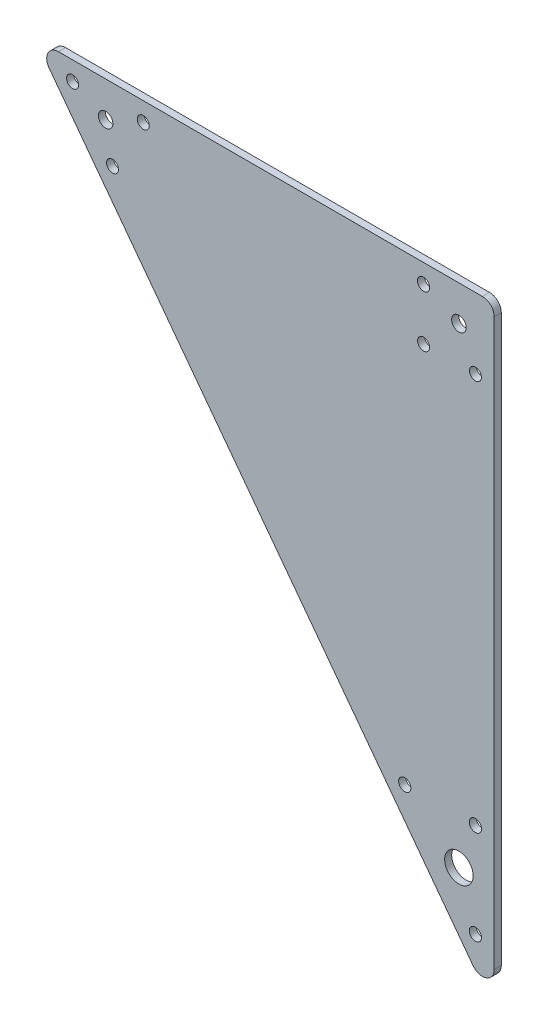
ISO-10303-21;
HEADER;
FILE_DESCRIPTION(('STEP AP214'),'2;1');
FILE_NAME('part.step','',(''),(''),'','','');
FILE_SCHEMA(('AUTOMOTIVE_DESIGN { 1 0 10303 214 1 1 1 1 }'));
ENDSEC;
DATA;
#1=APPLICATION_CONTEXT('core data for automotive mechanical design processes');
#2=APPLICATION_PROTOCOL_DEFINITION('international standard','automotive_design',2000,#1);
#3=PRODUCT_CONTEXT('',#1,'mechanical');
#4=PRODUCT('Part','Part','',(#3));
#5=PRODUCT_RELATED_PRODUCT_CATEGORY('part','',(#4));
#6=PRODUCT_DEFINITION_FORMATION('','',#4);
#7=PRODUCT_DEFINITION_CONTEXT('part definition',#1,'design');
#8=PRODUCT_DEFINITION('design','',#6,#7);
#9=PRODUCT_DEFINITION_SHAPE('','',#8);
#10=(LENGTH_UNIT() NAMED_UNIT(*) SI_UNIT(.MILLI.,.METRE.));
#11=(NAMED_UNIT(*) PLANE_ANGLE_UNIT() SI_UNIT($,.RADIAN.));
#12=(NAMED_UNIT(*) SI_UNIT($,.STERADIAN.) SOLID_ANGLE_UNIT());
#13=UNCERTAINTY_MEASURE_WITH_UNIT(LENGTH_MEASURE(1.E-05),#10,'distance_accuracy_value','');
#14=(GEOMETRIC_REPRESENTATION_CONTEXT(3) GLOBAL_UNCERTAINTY_ASSIGNED_CONTEXT((#13)) GLOBAL_UNIT_ASSIGNED_CONTEXT((#10,
#11,#12)) REPRESENTATION_CONTEXT('',''));
#15=CARTESIAN_POINT('',(0.,0.,0.));
#16=DIRECTION('',(0.,0.,1.));
#17=DIRECTION('',(1.,0.,0.));
#18=AXIS2_PLACEMENT_3D('',#15,#16,#17);
#19=CARTESIAN_POINT('',(0.,0.,3.));
#20=DIRECTION('',(0.,0.,1.));
#21=DIRECTION('',(1.,0.,0.));
#22=AXIS2_PLACEMENT_3D('',#19,#20,#21);
#23=PLANE('',#22);
#24=CARTESIAN_POINT('',(-23.,-181.,3.));
#25=DIRECTION('',(0.,0.,1.));
#26=DIRECTION('',(1.,0.,0.));
#27=AXIS2_PLACEMENT_3D('',#24,#25,#26);
#28=CIRCLE('',#27,2.6);
#29=CARTESIAN_POINT('',(-20.4,-181.,3.));
#30=VERTEX_POINT('',#29);
#31=EDGE_CURVE('E183',#30,#30,#28,.T.);
#32=ORIENTED_EDGE('',*,*,#31,.F.);
#33=EDGE_LOOP('',(#32));
#34=FACE_BOUND('',#33,.T.);
#35=CARTESIAN_POINT('',(-147.048935520436,-15.6014193060854,3.));
#36=DIRECTION('',(0.,0.,1.));
#37=DIRECTION('',(1.,0.,0.));
#38=AXIS2_PLACEMENT_3D('',#35,#36,#37);
#39=CIRCLE('',#38,2.54999999999999);
#40=CARTESIAN_POINT('',(-144.498935520436,-15.6014193060854,3.));
#41=VERTEX_POINT('',#40);
#42=EDGE_CURVE('E195',#41,#41,#39,.T.);
#43=ORIENTED_EDGE('',*,*,#42,.F.);
#44=EDGE_LOOP('',(#43));
#45=FACE_BOUND('',#44,.T.);
#46=CARTESIAN_POINT('',(-164.,7.,3.));
#47=DIRECTION('',(0.,0.,1.));
#48=DIRECTION('',(1.,0.,0.));
#49=AXIS2_PLACEMENT_3D('',#46,#47,#48);
#50=CIRCLE('',#49,2.54999999999999);
#51=CARTESIAN_POINT('',(-161.45,7.,3.));
#52=VERTEX_POINT('',#51);
#53=EDGE_CURVE('E205',#52,#52,#50,.T.);
#54=ORIENTED_EDGE('',*,*,#53,.F.);
#55=EDGE_LOOP('',(#54));
#56=FACE_BOUND('',#55,.T.);
#57=CARTESIAN_POINT('',(-15.,-15.,3.));
#58=DIRECTION('',(0.,0.,1.));
#59=DIRECTION('',(1.,0.,0.));
#60=AXIS2_PLACEMENT_3D('',#57,#58,#59);
#61=CIRCLE('',#60,2.54999999999999);
#62=CARTESIAN_POINT('',(-12.45,-15.,3.));
#63=VERTEX_POINT('',#62);
#64=EDGE_CURVE('E215',#63,#63,#61,.T.);
#65=ORIENTED_EDGE('',*,*,#64,.F.);
#66=EDGE_LOOP('',(#65));
#67=FACE_BOUND('',#66,.T.);
#68=CARTESIAN_POINT('',(0.,-200.,3.));
#69=DIRECTION('',(0.,0.,1.));
#70=DIRECTION('',(1.,0.,0.));
#71=AXIS2_PLACEMENT_3D('',#68,#69,#70);
#72=CIRCLE('',#71,6.05);
#73=CARTESIAN_POINT('',(6.05000000000002,-200.,3.));
#74=VERTEX_POINT('',#73);
#75=EDGE_CURVE('E225',#74,#74,#72,.T.);
#76=ORIENTED_EDGE('',*,*,#75,.F.);
#77=EDGE_LOOP('',(#76));
#78=FACE_BOUND('',#77,.T.);
#79=CARTESIAN_POINT('',(0.,0.,3.));
#80=DIRECTION('',(0.,0.,1.));
#81=DIRECTION('',(1.,0.,0.));
#82=AXIS2_PLACEMENT_3D('',#79,#80,#81);
#83=CIRCLE('',#82,3.1);
#84=CARTESIAN_POINT('',(3.1,0.,3.));
#85=VERTEX_POINT('',#84);
#86=EDGE_CURVE('E119',#85,#85,#83,.T.);
#87=ORIENTED_EDGE('',*,*,#86,.F.);
#88=EDGE_LOOP('',(#87));
#89=FACE_BOUND('',#88,.T.);
#90=DIRECTION('',(0.6,-0.8,0.));
#91=VECTOR('',#90,1.);
#92=CARTESIAN_POINT('',(-180.,15.,3.));
#93=LINE('',#92,#91);
#94=CARTESIAN_POINT('',(-174.,6.99999999999999,3.));
#95=VERTEX_POINT('',#94);
#96=CARTESIAN_POINT('',(6.00000000000006,-233.,3.));
#97=VERTEX_POINT('',#96);
#98=EDGE_CURVE('E117',#95,#97,#93,.T.);
#99=ORIENTED_EDGE('',*,*,#98,.T.);
#100=CARTESIAN_POINT('',(10.,-230.,3.));
#101=DIRECTION('',(0.,0.,1.));
#102=DIRECTION('',(1.,0.,0.));
#103=AXIS2_PLACEMENT_3D('',#100,#101,#102);
#104=CIRCLE('',#103,5.);
#105=CARTESIAN_POINT('',(15.,-230.,3.));
#106=VERTEX_POINT('',#105);
#107=EDGE_CURVE('E133',#97,#106,#104,.T.);
#108=ORIENTED_EDGE('',*,*,#107,.T.);
#109=DIRECTION('',(0.,1.,0.));
#110=VECTOR('',#109,1.);
#111=CARTESIAN_POINT('',(15.,15.,3.));
#112=LINE('',#111,#110);
#113=CARTESIAN_POINT('',(15.,10.,3.));
#114=VERTEX_POINT('',#113);
#115=EDGE_CURVE('E107',#106,#114,#112,.T.);
#116=ORIENTED_EDGE('',*,*,#115,.T.);
#117=CARTESIAN_POINT('',(9.99999999999998,10.,3.));
#118=DIRECTION('',(0.,0.,1.));
#119=DIRECTION('',(1.,0.,0.));
#120=AXIS2_PLACEMENT_3D('',#117,#118,#119);
#121=CIRCLE('',#120,5.);
#122=CARTESIAN_POINT('',(9.99999999999998,15.,3.));
#123=VERTEX_POINT('',#122);
#124=EDGE_CURVE('E55',#114,#123,#121,.T.);
#125=ORIENTED_EDGE('',*,*,#124,.T.);
#126=DIRECTION('',(-1.,0.,0.));
#127=VECTOR('',#126,1.);
#128=CARTESIAN_POINT('',(-180.,15.,3.));
#129=LINE('',#128,#127);
#130=CARTESIAN_POINT('',(-170.,15.,3.));
#131=VERTEX_POINT('',#130);
#132=EDGE_CURVE('E123',#123,#131,#129,.T.);
#133=ORIENTED_EDGE('',*,*,#132,.T.);
#134=CARTESIAN_POINT('',(-170.,10.,3.));
#135=DIRECTION('',(0.,0.,1.));
#136=DIRECTION('',(1.,0.,0.));
#137=AXIS2_PLACEMENT_3D('',#134,#135,#136);
#138=CIRCLE('',#137,5.);
#139=EDGE_CURVE('E131',#131,#95,#138,.T.);
#140=ORIENTED_EDGE('',*,*,#139,.T.);
#141=EDGE_LOOP('',(#99,#108,#116,#125,#133,#140));
#142=FACE_BOUND('',#141,.T.);
#143=CARTESIAN_POINT('',(-150.,0.,3.));
#144=DIRECTION('',(0.,0.,1.));
#145=DIRECTION('',(1.,0.,0.));
#146=AXIS2_PLACEMENT_3D('',#143,#144,#145);
#147=CIRCLE('',#146,3.09999999999999);
#148=CARTESIAN_POINT('',(-146.9,0.,3.));
#149=VERTEX_POINT('',#148);
#150=EDGE_CURVE('E158',#149,#149,#147,.T.);
#151=ORIENTED_EDGE('',*,*,#150,.F.);
#152=EDGE_LOOP('',(#151));
#153=FACE_BOUND('',#152,.T.);
#154=CARTESIAN_POINT('',(-15.,7.,3.));
#155=DIRECTION('',(0.,0.,1.));
#156=DIRECTION('',(1.,0.,0.));
#157=AXIS2_PLACEMENT_3D('',#154,#155,#156);
#158=CIRCLE('',#157,2.6);
#159=CARTESIAN_POINT('',(-12.4,7.,3.));
#160=VERTEX_POINT('',#159);
#161=EDGE_CURVE('E162',#160,#160,#158,.T.);
#162=ORIENTED_EDGE('',*,*,#161,.F.);
#163=EDGE_LOOP('',(#162));
#164=FACE_BOUND('',#163,.T.);
#165=CARTESIAN_POINT('',(7.,-15.,3.));
#166=DIRECTION('',(0.,0.,1.));
#167=DIRECTION('',(1.,0.,0.));
#168=AXIS2_PLACEMENT_3D('',#165,#166,#167);
#169=CIRCLE('',#168,2.55);
#170=CARTESIAN_POINT('',(9.55,-15.,3.));
#171=VERTEX_POINT('',#170);
#172=EDGE_CURVE('E166',#171,#171,#169,.T.);
#173=ORIENTED_EDGE('',*,*,#172,.F.);
#174=EDGE_LOOP('',(#173));
#175=FACE_BOUND('',#174,.T.);
#176=CARTESIAN_POINT('',(-134.,7.,3.));
#177=DIRECTION('',(0.,0.,1.));
#178=DIRECTION('',(1.,0.,0.));
#179=AXIS2_PLACEMENT_3D('',#176,#177,#178);
#180=CIRCLE('',#179,2.54999999999999);
#181=CARTESIAN_POINT('',(-131.45,7.,3.));
#182=VERTEX_POINT('',#181);
#183=EDGE_CURVE('E170',#182,#182,#180,.T.);
#184=ORIENTED_EDGE('',*,*,#183,.F.);
#185=EDGE_LOOP('',(#184));
#186=FACE_BOUND('',#185,.T.);
#187=CARTESIAN_POINT('',(7.00000000000002,-221.,3.));
#188=DIRECTION('',(0.,0.,1.));
#189=DIRECTION('',(1.,0.,0.));
#190=AXIS2_PLACEMENT_3D('',#187,#188,#189);
#191=CIRCLE('',#190,2.6);
#192=CARTESIAN_POINT('',(9.60000000000002,-221.,3.));
#193=VERTEX_POINT('',#192);
#194=EDGE_CURVE('E174',#193,#193,#191,.T.);
#195=ORIENTED_EDGE('',*,*,#194,.F.);
#196=EDGE_LOOP('',(#195));
#197=FACE_BOUND('',#196,.T.);
#198=CARTESIAN_POINT('',(7.00000000000003,-181.,3.));
#199=DIRECTION('',(0.,0.,1.));
#200=DIRECTION('',(1.,0.,0.));
#201=AXIS2_PLACEMENT_3D('',#198,#199,#200);
#202=CIRCLE('',#201,2.6);
#203=CARTESIAN_POINT('',(9.60000000000002,-181.,3.));
#204=VERTEX_POINT('',#203);
#205=EDGE_CURVE('E177',#204,#204,#202,.T.);
#206=ORIENTED_EDGE('',*,*,#205,.F.);
#207=EDGE_LOOP('',(#206));
#208=FACE_BOUND('',#207,.T.);
#209=ADVANCED_FACE('F35',(#34,#45,#56,#67,#78,#89,#142,#153,#164,#175,#186,#197,#208),#23,.T.);
#210=CARTESIAN_POINT('',(0.,0.,0.));
#211=DIRECTION('',(0.,0.,1.));
#212=DIRECTION('',(1.,0.,0.));
#213=AXIS2_PLACEMENT_3D('',#210,#211,#212);
#214=PLANE('',#213);
#215=DIRECTION('',(0.,1.,0.));
#216=VECTOR('',#215,1.);
#217=CARTESIAN_POINT('',(15.,15.,0.));
#218=LINE('',#217,#216);
#219=CARTESIAN_POINT('',(15.,-230.,0.));
#220=VERTEX_POINT('',#219);
#221=CARTESIAN_POINT('',(15.,10.,0.));
#222=VERTEX_POINT('',#221);
#223=EDGE_CURVE('E105',#220,#222,#218,.T.);
#224=ORIENTED_EDGE('',*,*,#223,.F.);
#225=CARTESIAN_POINT('',(10.,-230.,0.));
#226=DIRECTION('',(0.,0.,1.));
#227=DIRECTION('',(1.,0.,0.));
#228=AXIS2_PLACEMENT_3D('',#225,#226,#227);
#229=CIRCLE('',#228,5.);
#230=CARTESIAN_POINT('',(6.00000000000006,-233.,0.));
#231=VERTEX_POINT('',#230);
#232=EDGE_CURVE('E88',#220,#231,#229,.F.);
#233=ORIENTED_EDGE('',*,*,#232,.T.);
#234=DIRECTION('',(0.6,-0.8,0.));
#235=VECTOR('',#234,1.);
#236=CARTESIAN_POINT('',(-180.,15.,0.));
#237=LINE('',#236,#235);
#238=CARTESIAN_POINT('',(-174.,6.99999999999999,0.));
#239=VERTEX_POINT('',#238);
#240=EDGE_CURVE('E115',#239,#231,#237,.T.);
#241=ORIENTED_EDGE('',*,*,#240,.F.);
#242=CARTESIAN_POINT('',(-170.,10.,0.));
#243=DIRECTION('',(0.,0.,1.));
#244=DIRECTION('',(1.,0.,0.));
#245=AXIS2_PLACEMENT_3D('',#242,#243,#244);
#246=CIRCLE('',#245,5.);
#247=CARTESIAN_POINT('',(-170.,15.,0.));
#248=VERTEX_POINT('',#247);
#249=EDGE_CURVE('E99',#239,#248,#246,.F.);
#250=ORIENTED_EDGE('',*,*,#249,.T.);
#251=DIRECTION('',(-1.,0.,0.));
#252=VECTOR('',#251,1.);
#253=CARTESIAN_POINT('',(-180.,15.,0.));
#254=LINE('',#253,#252);
#255=CARTESIAN_POINT('',(9.99999999999998,15.,0.));
#256=VERTEX_POINT('',#255);
#257=EDGE_CURVE('E114',#256,#248,#254,.T.);
#258=ORIENTED_EDGE('',*,*,#257,.F.);
#259=CARTESIAN_POINT('',(9.99999999999998,10.,0.));
#260=DIRECTION('',(0.,0.,1.));
#261=DIRECTION('',(1.,0.,0.));
#262=AXIS2_PLACEMENT_3D('',#259,#260,#261);
#263=CIRCLE('',#262,5.);
#264=EDGE_CURVE('E108',#256,#222,#263,.F.);
#265=ORIENTED_EDGE('',*,*,#264,.T.);
#266=EDGE_LOOP('',(#224,#233,#241,#250,#258,#265));
#267=FACE_BOUND('',#266,.T.);
#268=CARTESIAN_POINT('',(0.,0.,0.));
#269=DIRECTION('',(0.,0.,1.));
#270=DIRECTION('',(1.,0.,0.));
#271=AXIS2_PLACEMENT_3D('',#268,#269,#270);
#272=CIRCLE('',#271,3.1);
#273=CARTESIAN_POINT('',(3.1,0.,0.));
#274=VERTEX_POINT('',#273);
#275=EDGE_CURVE('E149',#274,#274,#272,.T.);
#276=ORIENTED_EDGE('',*,*,#275,.T.);
#277=EDGE_LOOP('',(#276));
#278=FACE_BOUND('',#277,.T.);
#279=CARTESIAN_POINT('',(-150.,0.,0.));
#280=DIRECTION('',(0.,0.,1.));
#281=DIRECTION('',(1.,0.,0.));
#282=AXIS2_PLACEMENT_3D('',#279,#280,#281);
#283=CIRCLE('',#282,3.09999999999999);
#284=CARTESIAN_POINT('',(-146.9,0.,0.));
#285=VERTEX_POINT('',#284);
#286=EDGE_CURVE('E228',#285,#285,#283,.T.);
#287=ORIENTED_EDGE('',*,*,#286,.T.);
#288=EDGE_LOOP('',(#287));
#289=FACE_BOUND('',#288,.T.);
#290=CARTESIAN_POINT('',(0.,-200.,0.));
#291=DIRECTION('',(0.,0.,1.));
#292=DIRECTION('',(1.,0.,0.));
#293=AXIS2_PLACEMENT_3D('',#290,#291,#292);
#294=CIRCLE('',#293,6.05);
#295=CARTESIAN_POINT('',(6.05000000000002,-200.,0.));
#296=VERTEX_POINT('',#295);
#297=EDGE_CURVE('E222',#296,#296,#294,.T.);
#298=ORIENTED_EDGE('',*,*,#297,.T.);
#299=EDGE_LOOP('',(#298));
#300=FACE_BOUND('',#299,.T.);
#301=CARTESIAN_POINT('',(-15.,7.,0.));
#302=DIRECTION('',(0.,0.,1.));
#303=DIRECTION('',(1.,0.,0.));
#304=AXIS2_PLACEMENT_3D('',#301,#302,#303);
#305=CIRCLE('',#304,2.6);
#306=CARTESIAN_POINT('',(-12.4,7.,0.));
#307=VERTEX_POINT('',#306);
#308=EDGE_CURVE('E218',#307,#307,#305,.T.);
#309=ORIENTED_EDGE('',*,*,#308,.T.);
#310=EDGE_LOOP('',(#309));
#311=FACE_BOUND('',#310,.T.);
#312=CARTESIAN_POINT('',(-15.,-15.,0.));
#313=DIRECTION('',(0.,0.,1.));
#314=DIRECTION('',(1.,0.,0.));
#315=AXIS2_PLACEMENT_3D('',#312,#313,#314);
#316=CIRCLE('',#315,2.54999999999999);
#317=CARTESIAN_POINT('',(-12.45,-15.,0.));
#318=VERTEX_POINT('',#317);
#319=EDGE_CURVE('E212',#318,#318,#316,.T.);
#320=ORIENTED_EDGE('',*,*,#319,.T.);
#321=EDGE_LOOP('',(#320));
#322=FACE_BOUND('',#321,.T.);
#323=CARTESIAN_POINT('',(7.,-15.,0.));
#324=DIRECTION('',(0.,0.,1.));
#325=DIRECTION('',(1.,0.,0.));
#326=AXIS2_PLACEMENT_3D('',#323,#324,#325);
#327=CIRCLE('',#326,2.55);
#328=CARTESIAN_POINT('',(9.55,-15.,0.));
#329=VERTEX_POINT('',#328);
#330=EDGE_CURVE('E208',#329,#329,#327,.T.);
#331=ORIENTED_EDGE('',*,*,#330,.T.);
#332=EDGE_LOOP('',(#331));
#333=FACE_BOUND('',#332,.T.);
#334=CARTESIAN_POINT('',(-164.,7.,0.));
#335=DIRECTION('',(0.,0.,1.));
#336=DIRECTION('',(1.,0.,0.));
#337=AXIS2_PLACEMENT_3D('',#334,#335,#336);
#338=CIRCLE('',#337,2.54999999999999);
#339=CARTESIAN_POINT('',(-161.45,7.,0.));
#340=VERTEX_POINT('',#339);
#341=EDGE_CURVE('E202',#340,#340,#338,.T.);
#342=ORIENTED_EDGE('',*,*,#341,.T.);
#343=EDGE_LOOP('',(#342));
#344=FACE_BOUND('',#343,.T.);
#345=CARTESIAN_POINT('',(-134.,7.,0.));
#346=DIRECTION('',(0.,0.,1.));
#347=DIRECTION('',(1.,0.,0.));
#348=AXIS2_PLACEMENT_3D('',#345,#346,#347);
#349=CIRCLE('',#348,2.54999999999999);
#350=CARTESIAN_POINT('',(-131.45,7.,0.));
#351=VERTEX_POINT('',#350);
#352=EDGE_CURVE('E198',#351,#351,#349,.T.);
#353=ORIENTED_EDGE('',*,*,#352,.T.);
#354=EDGE_LOOP('',(#353));
#355=FACE_BOUND('',#354,.T.);
#356=CARTESIAN_POINT('',(-147.048935520436,-15.6014193060854,0.));
#357=DIRECTION('',(0.,0.,1.));
#358=DIRECTION('',(1.,0.,0.));
#359=AXIS2_PLACEMENT_3D('',#356,#357,#358);
#360=CIRCLE('',#359,2.54999999999999);
#361=CARTESIAN_POINT('',(-144.498935520436,-15.6014193060854,0.));
#362=VERTEX_POINT('',#361);
#363=EDGE_CURVE('E192',#362,#362,#360,.T.);
#364=ORIENTED_EDGE('',*,*,#363,.T.);
#365=EDGE_LOOP('',(#364));
#366=FACE_BOUND('',#365,.T.);
#367=CARTESIAN_POINT('',(7.00000000000002,-221.,0.));
#368=DIRECTION('',(0.,0.,1.));
#369=DIRECTION('',(1.,0.,0.));
#370=AXIS2_PLACEMENT_3D('',#367,#368,#369);
#371=CIRCLE('',#370,2.6);
#372=CARTESIAN_POINT('',(9.60000000000002,-221.,0.));
#373=VERTEX_POINT('',#372);
#374=EDGE_CURVE('E189',#373,#373,#371,.T.);
#375=ORIENTED_EDGE('',*,*,#374,.T.);
#376=EDGE_LOOP('',(#375));
#377=FACE_BOUND('',#376,.T.);
#378=CARTESIAN_POINT('',(-23.,-181.,0.));
#379=DIRECTION('',(0.,0.,1.));
#380=DIRECTION('',(1.,0.,0.));
#381=AXIS2_PLACEMENT_3D('',#378,#379,#380);
#382=CIRCLE('',#381,2.6);
#383=CARTESIAN_POINT('',(-20.4,-181.,0.));
#384=VERTEX_POINT('',#383);
#385=EDGE_CURVE('E179',#384,#384,#382,.T.);
#386=ORIENTED_EDGE('',*,*,#385,.T.);
#387=EDGE_LOOP('',(#386));
#388=FACE_BOUND('',#387,.T.);
#389=CARTESIAN_POINT('',(7.00000000000003,-181.,0.));
#390=DIRECTION('',(0.,0.,1.));
#391=DIRECTION('',(1.,0.,0.));
#392=AXIS2_PLACEMENT_3D('',#389,#390,#391);
#393=CIRCLE('',#392,2.6);
#394=CARTESIAN_POINT('',(9.60000000000002,-181.,0.));
#395=VERTEX_POINT('',#394);
#396=EDGE_CURVE('E180',#395,#395,#393,.T.);
#397=ORIENTED_EDGE('',*,*,#396,.T.);
#398=EDGE_LOOP('',(#397));
#399=FACE_BOUND('',#398,.T.);
#400=ADVANCED_FACE('F111',(#267,#278,#289,#300,#311,#322,#333,#344,#355,#366,#377,#388,#399),
#214,.F.);
#401=CARTESIAN_POINT('',(-180.,15.,3.));
#402=DIRECTION('',(0.8,0.6,0.));
#403=DIRECTION('',(-0.6,0.8,0.));
#404=AXIS2_PLACEMENT_3D('',#401,#402,#403);
#405=PLANE('',#404);
#406=ORIENTED_EDGE('',*,*,#240,.T.);
#407=DIRECTION('',(0.,0.,-1.));
#408=VECTOR('',#407,1.);
#409=CARTESIAN_POINT('',(6.00000000000001,-233.,3.));
#410=LINE('',#409,#408);
#411=EDGE_CURVE('E93',#231,#97,#410,.F.);
#412=ORIENTED_EDGE('',*,*,#411,.T.);
#413=ORIENTED_EDGE('',*,*,#98,.F.);
#414=DIRECTION('',(0.,0.,-1.));
#415=VECTOR('',#414,1.);
#416=CARTESIAN_POINT('',(-174.,7.,3.));
#417=LINE('',#416,#415);
#418=EDGE_CURVE('E98',#95,#239,#417,.T.);
#419=ORIENTED_EDGE('',*,*,#418,.T.);
#420=EDGE_LOOP('',(#406,#412,#413,#419));
#421=FACE_BOUND('',#420,.T.);
#422=ADVANCED_FACE('F144',(#421),#405,.F.);
#423=CARTESIAN_POINT('',(15.,15.,3.));
#424=DIRECTION('',(-1.,0.,0.));
#425=DIRECTION('',(0.,-1.,0.));
#426=AXIS2_PLACEMENT_3D('',#423,#424,#425);
#427=PLANE('',#426);
#428=ORIENTED_EDGE('',*,*,#115,.F.);
#429=DIRECTION('',(0.,0.,-1.));
#430=VECTOR('',#429,1.);
#431=CARTESIAN_POINT('',(15.,-230.,3.));
#432=LINE('',#431,#430);
#433=EDGE_CURVE('E92',#106,#220,#432,.T.);
#434=ORIENTED_EDGE('',*,*,#433,.T.);
#435=ORIENTED_EDGE('',*,*,#223,.T.);
#436=DIRECTION('',(0.,0.,-1.));
#437=VECTOR('',#436,1.);
#438=CARTESIAN_POINT('',(15.,10.,3.));
#439=LINE('',#438,#437);
#440=EDGE_CURVE('E109',#222,#114,#439,.F.);
#441=ORIENTED_EDGE('',*,*,#440,.T.);
#442=EDGE_LOOP('',(#428,#434,#435,#441));
#443=FACE_BOUND('',#442,.T.);
#444=ADVANCED_FACE('F104',(#443),#427,.F.);
#445=CARTESIAN_POINT('',(-180.,15.,3.));
#446=DIRECTION('',(0.,-1.,0.));
#447=DIRECTION('',(0.,0.,-1.));
#448=AXIS2_PLACEMENT_3D('',#445,#446,#447);
#449=PLANE('',#448);
#450=ORIENTED_EDGE('',*,*,#257,.T.);
#451=DIRECTION('',(0.,0.,-1.));
#452=VECTOR('',#451,1.);
#453=CARTESIAN_POINT('',(-170.,15.,3.));
#454=LINE('',#453,#452);
#455=EDGE_CURVE('E11',#248,#131,#454,.F.);
#456=ORIENTED_EDGE('',*,*,#455,.T.);
#457=ORIENTED_EDGE('',*,*,#132,.F.);
#458=DIRECTION('',(0.,0.,-1.));
#459=VECTOR('',#458,1.);
#460=CARTESIAN_POINT('',(9.99999999999998,15.,3.));
#461=LINE('',#460,#459);
#462=EDGE_CURVE('E43',#123,#256,#461,.T.);
#463=ORIENTED_EDGE('',*,*,#462,.T.);
#464=EDGE_LOOP('',(#450,#456,#457,#463));
#465=FACE_BOUND('',#464,.T.);
#466=ADVANCED_FACE('F136',(#465),#449,.F.);
#467=CARTESIAN_POINT('',(0.,0.,3.));
#468=DIRECTION('',(0.,0.,-1.));
#469=DIRECTION('',(-1.,0.,0.));
#470=AXIS2_PLACEMENT_3D('',#467,#468,#469);
#471=CYLINDRICAL_SURFACE('',#470,3.1);
#472=ORIENTED_EDGE('',*,*,#86,.T.);
#473=EDGE_LOOP('',(#472));
#474=FACE_BOUND('',#473,.T.);
#475=ORIENTED_EDGE('',*,*,#275,.F.);
#476=EDGE_LOOP('',(#475));
#477=FACE_BOUND('',#476,.T.);
#478=ADVANCED_FACE('F240',(#474,#477),#471,.F.);
#479=CARTESIAN_POINT('',(-150.,0.,3.));
#480=DIRECTION('',(0.,0.,-1.));
#481=DIRECTION('',(-1.,0.,0.));
#482=AXIS2_PLACEMENT_3D('',#479,#480,#481);
#483=CYLINDRICAL_SURFACE('',#482,3.09999999999999);
#484=ORIENTED_EDGE('',*,*,#150,.T.);
#485=EDGE_LOOP('',(#484));
#486=FACE_BOUND('',#485,.T.);
#487=ORIENTED_EDGE('',*,*,#286,.F.);
#488=EDGE_LOOP('',(#487));
#489=FACE_BOUND('',#488,.T.);
#490=ADVANCED_FACE('F242',(#486,#489),#483,.F.);
#491=CARTESIAN_POINT('',(0.,-200.,3.));
#492=DIRECTION('',(0.,0.,-1.));
#493=DIRECTION('',(-1.,0.,0.));
#494=AXIS2_PLACEMENT_3D('',#491,#492,#493);
#495=CYLINDRICAL_SURFACE('',#494,6.05);
#496=ORIENTED_EDGE('',*,*,#75,.T.);
#497=EDGE_LOOP('',(#496));
#498=FACE_BOUND('',#497,.T.);
#499=ORIENTED_EDGE('',*,*,#297,.F.);
#500=EDGE_LOOP('',(#499));
#501=FACE_BOUND('',#500,.T.);
#502=ADVANCED_FACE('F248',(#498,#501),#495,.F.);
#503=CARTESIAN_POINT('',(-15.,7.,3.));
#504=DIRECTION('',(0.,0.,-1.));
#505=DIRECTION('',(-1.,0.,0.));
#506=AXIS2_PLACEMENT_3D('',#503,#504,#505);
#507=CYLINDRICAL_SURFACE('',#506,2.6);
#508=ORIENTED_EDGE('',*,*,#161,.T.);
#509=EDGE_LOOP('',(#508));
#510=FACE_BOUND('',#509,.T.);
#511=ORIENTED_EDGE('',*,*,#308,.F.);
#512=EDGE_LOOP('',(#511));
#513=FACE_BOUND('',#512,.T.);
#514=ADVANCED_FACE('F387',(#510,#513),#507,.F.);
#515=CARTESIAN_POINT('',(-15.,-15.,3.));
#516=DIRECTION('',(0.,0.,-1.));
#517=DIRECTION('',(-1.,0.,0.));
#518=AXIS2_PLACEMENT_3D('',#515,#516,#517);
#519=CYLINDRICAL_SURFACE('',#518,2.54999999999999);
#520=ORIENTED_EDGE('',*,*,#64,.T.);
#521=EDGE_LOOP('',(#520));
#522=FACE_BOUND('',#521,.T.);
#523=ORIENTED_EDGE('',*,*,#319,.F.);
#524=EDGE_LOOP('',(#523));
#525=FACE_BOUND('',#524,.T.);
#526=ADVANCED_FACE('F377',(#522,#525),#519,.F.);
#527=CARTESIAN_POINT('',(7.,-15.,3.));
#528=DIRECTION('',(0.,0.,-1.));
#529=DIRECTION('',(-1.,0.,0.));
#530=AXIS2_PLACEMENT_3D('',#527,#528,#529);
#531=CYLINDRICAL_SURFACE('',#530,2.55);
#532=ORIENTED_EDGE('',*,*,#172,.T.);
#533=EDGE_LOOP('',(#532));
#534=FACE_BOUND('',#533,.T.);
#535=ORIENTED_EDGE('',*,*,#330,.F.);
#536=EDGE_LOOP('',(#535));
#537=FACE_BOUND('',#536,.T.);
#538=ADVANCED_FACE('F367',(#534,#537),#531,.F.);
#539=CARTESIAN_POINT('',(-164.,7.,3.));
#540=DIRECTION('',(0.,0.,-1.));
#541=DIRECTION('',(-1.,0.,0.));
#542=AXIS2_PLACEMENT_3D('',#539,#540,#541);
#543=CYLINDRICAL_SURFACE('',#542,2.54999999999999);
#544=ORIENTED_EDGE('',*,*,#53,.T.);
#545=EDGE_LOOP('',(#544));
#546=FACE_BOUND('',#545,.T.);
#547=ORIENTED_EDGE('',*,*,#341,.F.);
#548=EDGE_LOOP('',(#547));
#549=FACE_BOUND('',#548,.T.);
#550=ADVANCED_FACE('F357',(#546,#549),#543,.F.);
#551=CARTESIAN_POINT('',(-134.,7.,3.));
#552=DIRECTION('',(0.,0.,-1.));
#553=DIRECTION('',(-1.,0.,0.));
#554=AXIS2_PLACEMENT_3D('',#551,#552,#553);
#555=CYLINDRICAL_SURFACE('',#554,2.54999999999999);
#556=ORIENTED_EDGE('',*,*,#183,.T.);
#557=EDGE_LOOP('',(#556));
#558=FACE_BOUND('',#557,.T.);
#559=ORIENTED_EDGE('',*,*,#352,.F.);
#560=EDGE_LOOP('',(#559));
#561=FACE_BOUND('',#560,.T.);
#562=ADVANCED_FACE('F347',(#558,#561),#555,.F.);
#563=CARTESIAN_POINT('',(-147.048935520436,-15.6014193060854,3.));
#564=DIRECTION('',(0.,0.,-1.));
#565=DIRECTION('',(-1.,0.,0.));
#566=AXIS2_PLACEMENT_3D('',#563,#564,#565);
#567=CYLINDRICAL_SURFACE('',#566,2.54999999999999);
#568=ORIENTED_EDGE('',*,*,#42,.T.);
#569=EDGE_LOOP('',(#568));
#570=FACE_BOUND('',#569,.T.);
#571=ORIENTED_EDGE('',*,*,#363,.F.);
#572=EDGE_LOOP('',(#571));
#573=FACE_BOUND('',#572,.T.);
#574=ADVANCED_FACE('F337',(#570,#573),#567,.F.);
#575=CARTESIAN_POINT('',(7.00000000000002,-221.,3.));
#576=DIRECTION('',(0.,0.,-1.));
#577=DIRECTION('',(-1.,0.,0.));
#578=AXIS2_PLACEMENT_3D('',#575,#576,#577);
#579=CYLINDRICAL_SURFACE('',#578,2.6);
#580=ORIENTED_EDGE('',*,*,#194,.T.);
#581=EDGE_LOOP('',(#580));
#582=FACE_BOUND('',#581,.T.);
#583=ORIENTED_EDGE('',*,*,#374,.F.);
#584=EDGE_LOOP('',(#583));
#585=FACE_BOUND('',#584,.T.);
#586=ADVANCED_FACE('F327',(#582,#585),#579,.F.);
#587=CARTESIAN_POINT('',(-23.,-181.,3.));
#588=DIRECTION('',(0.,0.,-1.));
#589=DIRECTION('',(-1.,0.,0.));
#590=AXIS2_PLACEMENT_3D('',#587,#588,#589);
#591=CYLINDRICAL_SURFACE('',#590,2.6);
#592=ORIENTED_EDGE('',*,*,#31,.T.);
#593=EDGE_LOOP('',(#592));
#594=FACE_BOUND('',#593,.T.);
#595=ORIENTED_EDGE('',*,*,#385,.F.);
#596=EDGE_LOOP('',(#595));
#597=FACE_BOUND('',#596,.T.);
#598=ADVANCED_FACE('F318',(#594,#597),#591,.F.);
#599=CARTESIAN_POINT('',(7.00000000000003,-181.,3.));
#600=DIRECTION('',(0.,0.,-1.));
#601=DIRECTION('',(-1.,0.,0.));
#602=AXIS2_PLACEMENT_3D('',#599,#600,#601);
#603=CYLINDRICAL_SURFACE('',#602,2.6);
#604=ORIENTED_EDGE('',*,*,#205,.T.);
#605=EDGE_LOOP('',(#604));
#606=FACE_BOUND('',#605,.T.);
#607=ORIENTED_EDGE('',*,*,#396,.F.);
#608=EDGE_LOOP('',(#607));
#609=FACE_BOUND('',#608,.T.);
#610=ADVANCED_FACE('F261',(#606,#609),#603,.F.);
#611=CARTESIAN_POINT('',(10.,-230.,3.));
#612=DIRECTION('',(0.,0.,-1.));
#613=DIRECTION('',(-1.,0.,0.));
#614=AXIS2_PLACEMENT_3D('',#611,#612,#613);
#615=CYLINDRICAL_SURFACE('',#614,5.);
#616=ORIENTED_EDGE('',*,*,#107,.F.);
#617=ORIENTED_EDGE('',*,*,#411,.F.);
#618=ORIENTED_EDGE('',*,*,#232,.F.);
#619=ORIENTED_EDGE('',*,*,#433,.F.);
#620=EDGE_LOOP('',(#616,#617,#618,#619));
#621=FACE_BOUND('',#620,.T.);
#622=ADVANCED_FACE('F91',(#621),#615,.T.);
#623=CARTESIAN_POINT('',(-170.,10.,3.));
#624=DIRECTION('',(0.,0.,-1.));
#625=DIRECTION('',(-1.,0.,0.));
#626=AXIS2_PLACEMENT_3D('',#623,#624,#625);
#627=CYLINDRICAL_SURFACE('',#626,5.);
#628=ORIENTED_EDGE('',*,*,#139,.F.);
#629=ORIENTED_EDGE('',*,*,#455,.F.);
#630=ORIENTED_EDGE('',*,*,#249,.F.);
#631=ORIENTED_EDGE('',*,*,#418,.F.);
#632=EDGE_LOOP('',(#628,#629,#630,#631));
#633=FACE_BOUND('',#632,.T.);
#634=ADVANCED_FACE('F141',(#633),#627,.T.);
#635=CARTESIAN_POINT('',(9.99999999999998,10.,3.));
#636=DIRECTION('',(0.,0.,-1.));
#637=DIRECTION('',(-1.,0.,0.));
#638=AXIS2_PLACEMENT_3D('',#635,#636,#637);
#639=CYLINDRICAL_SURFACE('',#638,5.);
#640=ORIENTED_EDGE('',*,*,#124,.F.);
#641=ORIENTED_EDGE('',*,*,#440,.F.);
#642=ORIENTED_EDGE('',*,*,#264,.F.);
#643=ORIENTED_EDGE('',*,*,#462,.F.);
#644=EDGE_LOOP('',(#640,#641,#642,#643));
#645=FACE_BOUND('',#644,.T.);
#646=ADVANCED_FACE('F37',(#645),#639,.T.);
#647=CLOSED_SHELL('',(#209,#400,#422,#444,#466,#478,#490,#502,#514,#526,#538,#550,#562,#574,
#586,#598,#610,#622,#634,#646));
#648=MANIFOLD_SOLID_BREP('B2',#647);
#649=ADVANCED_BREP_SHAPE_REPRESENTATION('',(#18,#648),#14);
#650=SHAPE_DEFINITION_REPRESENTATION(#9,#649);
ENDSEC;
END-ISO-10303-21;
